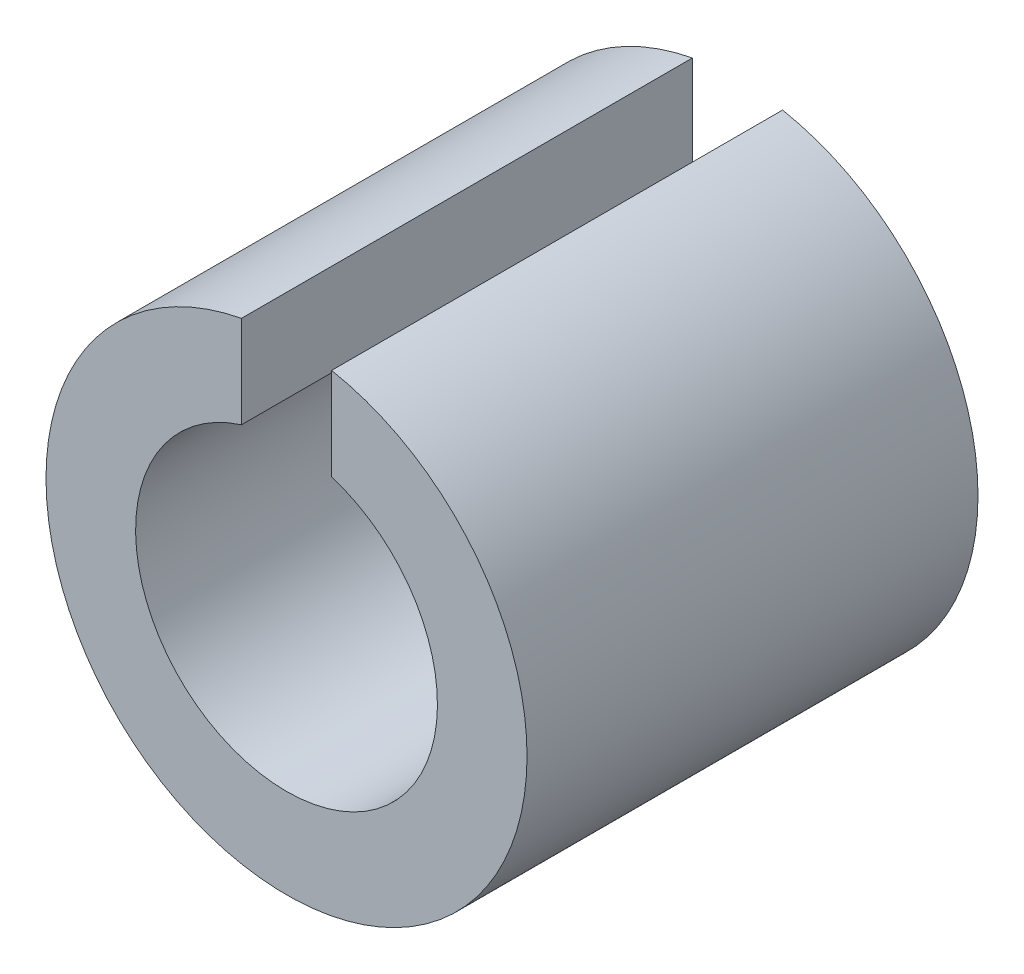
ISO-10303-21;
HEADER;
FILE_DESCRIPTION(('STEP AP214'),'2;1');
FILE_NAME('part.step','',(''),(''),'','','');
FILE_SCHEMA(('AUTOMOTIVE_DESIGN { 1 0 10303 214 1 1 1 1 }'));
ENDSEC;
DATA;
#1=APPLICATION_CONTEXT('core data for automotive mechanical design processes');
#2=APPLICATION_PROTOCOL_DEFINITION('international standard','automotive_design',2000,#1);
#3=PRODUCT_CONTEXT('',#1,'mechanical');
#4=PRODUCT('Part','Part','',(#3));
#5=PRODUCT_RELATED_PRODUCT_CATEGORY('part','',(#4));
#6=PRODUCT_DEFINITION_FORMATION('','',#4);
#7=PRODUCT_DEFINITION_CONTEXT('part definition',#1,'design');
#8=PRODUCT_DEFINITION('design','',#6,#7);
#9=PRODUCT_DEFINITION_SHAPE('','',#8);
#10=(LENGTH_UNIT() NAMED_UNIT(*) SI_UNIT(.MILLI.,.METRE.));
#11=(NAMED_UNIT(*) PLANE_ANGLE_UNIT() SI_UNIT($,.RADIAN.));
#12=(NAMED_UNIT(*) SI_UNIT($,.STERADIAN.) SOLID_ANGLE_UNIT());
#13=UNCERTAINTY_MEASURE_WITH_UNIT(LENGTH_MEASURE(1.E-05),#10,'distance_accuracy_value','');
#14=(GEOMETRIC_REPRESENTATION_CONTEXT(3) GLOBAL_UNCERTAINTY_ASSIGNED_CONTEXT((#13)) GLOBAL_UNIT_ASSIGNED_CONTEXT((#10,
#11,#12)) REPRESENTATION_CONTEXT('',''));
#15=CARTESIAN_POINT('',(0.,0.,0.));
#16=DIRECTION('',(0.,0.,1.));
#17=DIRECTION('',(1.,0.,0.));
#18=AXIS2_PLACEMENT_3D('',#15,#16,#17);
#19=CARTESIAN_POINT('',(0.75,3.92905841137543,3.75));
#20=DIRECTION('',(1.,0.,0.));
#21=DIRECTION('',(0.,1.,0.));
#22=AXIS2_PLACEMENT_3D('',#19,#20,#21);
#23=PLANE('',#22);
#24=DIRECTION('',(0.,0.,-1.));
#25=VECTOR('',#24,1.);
#26=CARTESIAN_POINT('',(0.75,2.39532878745278,3.75));
#27=LINE('',#26,#25);
#28=CARTESIAN_POINT('',(0.75,2.39532878745278,-3.75));
#29=VERTEX_POINT('',#28);
#30=CARTESIAN_POINT('',(0.75,2.39532878745278,3.75));
#31=VERTEX_POINT('',#30);
#32=EDGE_CURVE('E59',#29,#31,#27,.F.);
#33=ORIENTED_EDGE('',*,*,#32,.T.);
#34=DIRECTION('',(0.,1.,0.));
#35=VECTOR('',#34,1.);
#36=CARTESIAN_POINT('',(0.75,3.92905841137543,3.75));
#37=LINE('',#36,#35);
#38=CARTESIAN_POINT('',(0.75,3.92905841137543,3.75));
#39=VERTEX_POINT('',#38);
#40=EDGE_CURVE('E66',#39,#31,#37,.F.);
#41=ORIENTED_EDGE('',*,*,#40,.F.);
#42=DIRECTION('',(0.,0.,-1.));
#43=VECTOR('',#42,1.);
#44=CARTESIAN_POINT('',(0.75,3.92905841137543,3.75));
#45=LINE('',#44,#43);
#46=CARTESIAN_POINT('',(0.75,3.92905841137543,-3.75));
#47=VERTEX_POINT('',#46);
#48=EDGE_CURVE('E64',#47,#39,#45,.F.);
#49=ORIENTED_EDGE('',*,*,#48,.F.);
#50=DIRECTION('',(0.,1.,0.));
#51=VECTOR('',#50,1.);
#52=CARTESIAN_POINT('',(0.75,3.92905841137543,-3.75));
#53=LINE('',#52,#51);
#54=EDGE_CURVE('E34',#29,#47,#53,.T.);
#55=ORIENTED_EDGE('',*,*,#54,.F.);
#56=EDGE_LOOP('',(#33,#41,#49,#55));
#57=FACE_BOUND('',#56,.T.);
#58=ADVANCED_FACE('F16',(#57),#23,.F.);
#59=CARTESIAN_POINT('',(-0.75,2.39532878745278,3.75));
#60=DIRECTION('',(-1.,0.,0.));
#61=DIRECTION('',(0.,-1.,0.));
#62=AXIS2_PLACEMENT_3D('',#59,#60,#61);
#63=PLANE('',#62);
#64=DIRECTION('',(0.,0.,-1.));
#65=VECTOR('',#64,1.);
#66=CARTESIAN_POINT('',(-0.75,3.92905841137543,3.75));
#67=LINE('',#66,#65);
#68=CARTESIAN_POINT('',(-0.75,3.92905841137543,3.75));
#69=VERTEX_POINT('',#68);
#70=CARTESIAN_POINT('',(-0.75,3.92905841137543,-3.75));
#71=VERTEX_POINT('',#70);
#72=EDGE_CURVE('E76',#69,#71,#67,.T.);
#73=ORIENTED_EDGE('',*,*,#72,.F.);
#74=DIRECTION('',(0.,1.,0.));
#75=VECTOR('',#74,1.);
#76=CARTESIAN_POINT('',(-0.75,0.,3.75));
#77=LINE('',#76,#75);
#78=CARTESIAN_POINT('',(-0.75,2.39532878745278,3.75));
#79=VERTEX_POINT('',#78);
#80=EDGE_CURVE('E63',#79,#69,#77,.T.);
#81=ORIENTED_EDGE('',*,*,#80,.F.);
#82=DIRECTION('',(0.,0.,-1.));
#83=VECTOR('',#82,1.);
#84=CARTESIAN_POINT('',(-0.75,2.39532878745278,3.75));
#85=LINE('',#84,#83);
#86=CARTESIAN_POINT('',(-0.75,2.39532878745278,-3.75));
#87=VERTEX_POINT('',#86);
#88=EDGE_CURVE('E54',#79,#87,#85,.T.);
#89=ORIENTED_EDGE('',*,*,#88,.T.);
#90=DIRECTION('',(0.,-1.,0.));
#91=VECTOR('',#90,1.);
#92=CARTESIAN_POINT('',(-0.75,2.39532878745278,-3.75));
#93=LINE('',#92,#91);
#94=EDGE_CURVE('E72',#71,#87,#93,.T.);
#95=ORIENTED_EDGE('',*,*,#94,.F.);
#96=EDGE_LOOP('',(#73,#81,#89,#95));
#97=FACE_BOUND('',#96,.T.);
#98=ADVANCED_FACE('F88',(#97),#63,.F.);
#99=CARTESIAN_POINT('',(0.,0.,3.75));
#100=DIRECTION('',(0.,0.,-1.));
#101=DIRECTION('',(-1.,0.,0.));
#102=AXIS2_PLACEMENT_3D('',#99,#100,#101);
#103=CYLINDRICAL_SURFACE('',#102,2.51);
#104=CARTESIAN_POINT('',(0.,0.,3.75));
#105=DIRECTION('',(0.,0.,-1.));
#106=DIRECTION('',(-1.,0.,0.));
#107=AXIS2_PLACEMENT_3D('',#104,#105,#106);
#108=CIRCLE('',#107,2.51);
#109=EDGE_CURVE('E19',#31,#79,#108,.T.);
#110=ORIENTED_EDGE('',*,*,#109,.F.);
#111=ORIENTED_EDGE('',*,*,#32,.F.);
#112=CARTESIAN_POINT('',(0.,0.,-3.75));
#113=DIRECTION('',(0.,0.,-1.));
#114=DIRECTION('',(-1.,0.,0.));
#115=AXIS2_PLACEMENT_3D('',#112,#113,#114);
#116=CIRCLE('',#115,2.51);
#117=EDGE_CURVE('E78',#29,#87,#116,.T.);
#118=ORIENTED_EDGE('',*,*,#117,.T.);
#119=ORIENTED_EDGE('',*,*,#88,.F.);
#120=EDGE_LOOP('',(#110,#111,#118,#119));
#121=FACE_BOUND('',#120,.T.);
#122=ADVANCED_FACE('F58',(#121),#103,.F.);
#123=CARTESIAN_POINT('',(0.,0.,3.75));
#124=DIRECTION('',(0.,0.,1.));
#125=DIRECTION('',(1.,0.,0.));
#126=AXIS2_PLACEMENT_3D('',#123,#124,#125);
#127=PLANE('',#126);
#128=CARTESIAN_POINT('',(0.,0.,3.75));
#129=DIRECTION('',(0.,0.,-1.));
#130=DIRECTION('',(-1.,0.,0.));
#131=AXIS2_PLACEMENT_3D('',#128,#129,#130);
#132=CIRCLE('',#131,4.);
#133=EDGE_CURVE('E25',#39,#69,#132,.T.);
#134=ORIENTED_EDGE('',*,*,#133,.F.);
#135=ORIENTED_EDGE('',*,*,#40,.T.);
#136=ORIENTED_EDGE('',*,*,#109,.T.);
#137=ORIENTED_EDGE('',*,*,#80,.T.);
#138=EDGE_LOOP('',(#134,#135,#136,#137));
#139=FACE_BOUND('',#138,.T.);
#140=ADVANCED_FACE('F67',(#139),#127,.T.);
#141=CARTESIAN_POINT('',(0.,0.,-3.75));
#142=DIRECTION('',(0.,0.,1.));
#143=DIRECTION('',(1.,0.,0.));
#144=AXIS2_PLACEMENT_3D('',#141,#142,#143);
#145=PLANE('',#144);
#146=ORIENTED_EDGE('',*,*,#54,.T.);
#147=CARTESIAN_POINT('',(0.,0.,-3.75));
#148=DIRECTION('',(0.,0.,-1.));
#149=DIRECTION('',(-1.,0.,0.));
#150=AXIS2_PLACEMENT_3D('',#147,#148,#149);
#151=CIRCLE('',#150,4.);
#152=EDGE_CURVE('E10',#71,#47,#151,.F.);
#153=ORIENTED_EDGE('',*,*,#152,.F.);
#154=ORIENTED_EDGE('',*,*,#94,.T.);
#155=ORIENTED_EDGE('',*,*,#117,.F.);
#156=EDGE_LOOP('',(#146,#153,#154,#155));
#157=FACE_BOUND('',#156,.T.);
#158=ADVANCED_FACE('F85',(#157),#145,.F.);
#159=CARTESIAN_POINT('',(0.,0.,3.75));
#160=DIRECTION('',(0.,0.,-1.));
#161=DIRECTION('',(-1.,0.,0.));
#162=AXIS2_PLACEMENT_3D('',#159,#160,#161);
#163=CYLINDRICAL_SURFACE('',#162,4.);
#164=ORIENTED_EDGE('',*,*,#133,.T.);
#165=ORIENTED_EDGE('',*,*,#72,.T.);
#166=ORIENTED_EDGE('',*,*,#152,.T.);
#167=ORIENTED_EDGE('',*,*,#48,.T.);
#168=EDGE_LOOP('',(#164,#165,#166,#167));
#169=FACE_BOUND('',#168,.T.);
#170=ADVANCED_FACE('F90',(#169),#163,.T.);
#171=CLOSED_SHELL('',(#58,#98,#122,#140,#158,#170));
#172=MANIFOLD_SOLID_BREP('B1',#171);
#173=ADVANCED_BREP_SHAPE_REPRESENTATION('',(#18,#172),#14);
#174=SHAPE_DEFINITION_REPRESENTATION(#9,#173);
ENDSEC;
END-ISO-10303-21;
